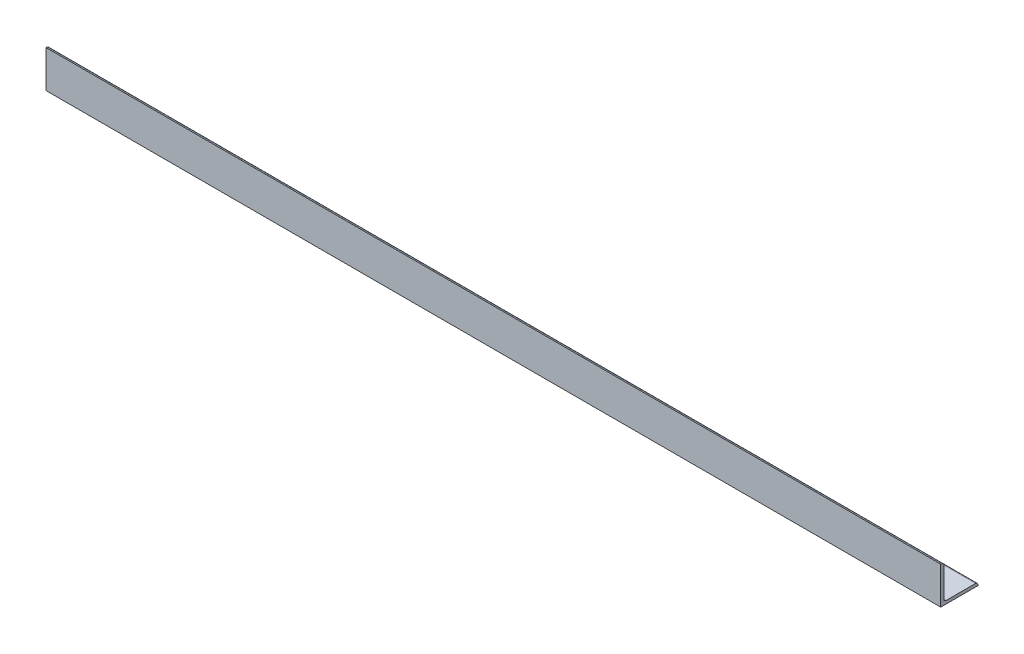
ISO-10303-21;
HEADER;
FILE_DESCRIPTION(('STEP AP214'),'2;1');
FILE_NAME('part.step','',(''),(''),'','','');
FILE_SCHEMA(('AUTOMOTIVE_DESIGN { 1 0 10303 214 1 1 1 1 }'));
ENDSEC;
DATA;
#1=APPLICATION_CONTEXT('core data for automotive mechanical design processes');
#2=APPLICATION_PROTOCOL_DEFINITION('international standard','automotive_design',2000,#1);
#3=PRODUCT_CONTEXT('',#1,'mechanical');
#4=PRODUCT('Part','Part','',(#3));
#5=PRODUCT_RELATED_PRODUCT_CATEGORY('part','',(#4));
#6=PRODUCT_DEFINITION_FORMATION('','',#4);
#7=PRODUCT_DEFINITION_CONTEXT('part definition',#1,'design');
#8=PRODUCT_DEFINITION('design','',#6,#7);
#9=PRODUCT_DEFINITION_SHAPE('','',#8);
#10=(LENGTH_UNIT() NAMED_UNIT(*) SI_UNIT(.MILLI.,.METRE.));
#11=(NAMED_UNIT(*) PLANE_ANGLE_UNIT() SI_UNIT($,.RADIAN.));
#12=(NAMED_UNIT(*) SI_UNIT($,.STERADIAN.) SOLID_ANGLE_UNIT());
#13=UNCERTAINTY_MEASURE_WITH_UNIT(LENGTH_MEASURE(1.E-05),#10,'distance_accuracy_value','');
#14=(GEOMETRIC_REPRESENTATION_CONTEXT(3) GLOBAL_UNCERTAINTY_ASSIGNED_CONTEXT((#13)) GLOBAL_UNIT_ASSIGNED_CONTEXT((#10,
#11,#12)) REPRESENTATION_CONTEXT('',''));
#15=CARTESIAN_POINT('',(0.,0.,0.));
#16=DIRECTION('',(0.,0.,1.));
#17=DIRECTION('',(1.,0.,0.));
#18=AXIS2_PLACEMENT_3D('',#15,#16,#17);
#19=CARTESIAN_POINT('',(-914.4,76.2,0.));
#20=DIRECTION('',(0.,1.,0.));
#21=DIRECTION('',(0.,0.,1.));
#22=AXIS2_PLACEMENT_3D('',#19,#20,#21);
#23=PLANE('',#22);
#24=DIRECTION('',(1.,0.,0.));
#25=VECTOR('',#24,1.);
#26=CARTESIAN_POINT('',(-914.4,76.2,0.));
#27=LINE('',#26,#25);
#28=CARTESIAN_POINT('',(-914.4,76.2,0.));
#29=VERTEX_POINT('',#28);
#30=CARTESIAN_POINT('',(914.4,76.2,0.));
#31=VERTEX_POINT('',#30);
#32=EDGE_CURVE('E40',#29,#31,#27,.T.);
#33=ORIENTED_EDGE('',*,*,#32,.T.);
#34=DIRECTION('',(0.,0.,1.));
#35=VECTOR('',#34,1.);
#36=CARTESIAN_POINT('',(914.4,76.2,0.));
#37=LINE('',#36,#35);
#38=CARTESIAN_POINT('',(914.4,76.2,-1.26999999999996));
#39=VERTEX_POINT('',#38);
#40=EDGE_CURVE('E107',#39,#31,#37,.T.);
#41=ORIENTED_EDGE('',*,*,#40,.F.);
#42=DIRECTION('',(1.,0.,0.));
#43=VECTOR('',#42,1.);
#44=CARTESIAN_POINT('',(-914.4,76.2,-1.26999999999996));
#45=LINE('',#44,#43);
#46=CARTESIAN_POINT('',(-914.4,76.2,-1.26999999999996));
#47=VERTEX_POINT('',#46);
#48=EDGE_CURVE('E11',#47,#39,#45,.T.);
#49=ORIENTED_EDGE('',*,*,#48,.F.);
#50=DIRECTION('',(0.,0.,1.));
#51=VECTOR('',#50,1.);
#52=CARTESIAN_POINT('',(-914.4,76.2,0.));
#53=LINE('',#52,#51);
#54=EDGE_CURVE('E108',#47,#29,#53,.T.);
#55=ORIENTED_EDGE('',*,*,#54,.T.);
#56=EDGE_LOOP('',(#33,#41,#49,#55));
#57=FACE_BOUND('',#56,.T.);
#58=ADVANCED_FACE('F37',(#57),#23,.T.);
#59=CARTESIAN_POINT('',(-914.4,71.12,-1.27));
#60=DIRECTION('',(1.,0.,0.));
#61=DIRECTION('',(0.,0.,-1.));
#62=AXIS2_PLACEMENT_3D('',#59,#60,#61);
#63=CYLINDRICAL_SURFACE('',#62,5.08);
#64=ORIENTED_EDGE('',*,*,#48,.T.);
#65=CARTESIAN_POINT('',(914.4,71.12,-1.27));
#66=DIRECTION('',(1.,0.,0.));
#67=DIRECTION('',(0.,0.,-1.));
#68=AXIS2_PLACEMENT_3D('',#65,#66,#67);
#69=CIRCLE('',#68,5.08);
#70=CARTESIAN_POINT('',(914.4,71.12,-6.35));
#71=VERTEX_POINT('',#70);
#72=EDGE_CURVE('E125',#71,#39,#69,.T.);
#73=ORIENTED_EDGE('',*,*,#72,.F.);
#74=DIRECTION('',(1.,0.,0.));
#75=VECTOR('',#74,1.);
#76=CARTESIAN_POINT('',(-914.4,71.12,-6.35));
#77=LINE('',#76,#75);
#78=CARTESIAN_POINT('',(-914.4,71.12,-6.35));
#79=VERTEX_POINT('',#78);
#80=EDGE_CURVE('E45',#79,#71,#77,.T.);
#81=ORIENTED_EDGE('',*,*,#80,.F.);
#82=CARTESIAN_POINT('',(-914.4,71.12,-1.27));
#83=DIRECTION('',(1.,0.,0.));
#84=DIRECTION('',(0.,0.,-1.));
#85=AXIS2_PLACEMENT_3D('',#82,#83,#84);
#86=CIRCLE('',#85,5.08);
#87=EDGE_CURVE('E113',#79,#47,#86,.T.);
#88=ORIENTED_EDGE('',*,*,#87,.T.);
#89=EDGE_LOOP('',(#64,#73,#81,#88));
#90=FACE_BOUND('',#89,.T.);
#91=ADVANCED_FACE('F201',(#90),#63,.T.);
#92=CARTESIAN_POINT('',(-914.4,71.12,-6.35));
#93=DIRECTION('',(0.,0.,-1.));
#94=DIRECTION('',(-1.,0.,0.));
#95=AXIS2_PLACEMENT_3D('',#92,#93,#94);
#96=PLANE('',#95);
#97=ORIENTED_EDGE('',*,*,#80,.T.);
#98=DIRECTION('',(0.,1.,0.));
#99=VECTOR('',#98,1.);
#100=CARTESIAN_POINT('',(914.4,71.12,-6.35));
#101=LINE('',#100,#99);
#102=CARTESIAN_POINT('',(914.4,11.43,-6.35));
#103=VERTEX_POINT('',#102);
#104=EDGE_CURVE('E141',#103,#71,#101,.T.);
#105=ORIENTED_EDGE('',*,*,#104,.F.);
#106=DIRECTION('',(1.,0.,0.));
#107=VECTOR('',#106,1.);
#108=CARTESIAN_POINT('',(-914.4,11.43,-6.35));
#109=LINE('',#108,#107);
#110=CARTESIAN_POINT('',(-914.4,11.43,-6.35));
#111=VERTEX_POINT('',#110);
#112=EDGE_CURVE('E166',#111,#103,#109,.T.);
#113=ORIENTED_EDGE('',*,*,#112,.F.);
#114=DIRECTION('',(0.,1.,0.));
#115=VECTOR('',#114,1.);
#116=CARTESIAN_POINT('',(-914.4,71.12,-6.35));
#117=LINE('',#116,#115);
#118=EDGE_CURVE('E162',#111,#79,#117,.T.);
#119=ORIENTED_EDGE('',*,*,#118,.T.);
#120=EDGE_LOOP('',(#97,#105,#113,#119));
#121=FACE_BOUND('',#120,.T.);
#122=ADVANCED_FACE('F199',(#121),#96,.T.);
#123=CARTESIAN_POINT('',(-914.4,11.43,-11.43));
#124=DIRECTION('',(1.,0.,0.));
#125=DIRECTION('',(0.,0.,-1.));
#126=AXIS2_PLACEMENT_3D('',#123,#124,#125);
#127=CYLINDRICAL_SURFACE('',#126,5.08);
#128=ORIENTED_EDGE('',*,*,#112,.T.);
#129=CARTESIAN_POINT('',(914.4,11.43,-11.43));
#130=DIRECTION('',(-1.,0.,0.));
#131=DIRECTION('',(0.,0.,-1.));
#132=AXIS2_PLACEMENT_3D('',#129,#130,#131);
#133=CIRCLE('',#132,5.08);
#134=CARTESIAN_POINT('',(914.4,6.35,-11.43));
#135=VERTEX_POINT('',#134);
#136=EDGE_CURVE('E138',#135,#103,#133,.T.);
#137=ORIENTED_EDGE('',*,*,#136,.F.);
#138=DIRECTION('',(1.,0.,0.));
#139=VECTOR('',#138,1.);
#140=CARTESIAN_POINT('',(-914.4,6.35,-11.43));
#141=LINE('',#140,#139);
#142=CARTESIAN_POINT('',(-914.4,6.35,-11.43));
#143=VERTEX_POINT('',#142);
#144=EDGE_CURVE('E168',#143,#135,#141,.T.);
#145=ORIENTED_EDGE('',*,*,#144,.F.);
#146=CARTESIAN_POINT('',(-914.4,11.43,-11.43));
#147=DIRECTION('',(-1.,0.,0.));
#148=DIRECTION('',(0.,0.,-1.));
#149=AXIS2_PLACEMENT_3D('',#146,#147,#148);
#150=CIRCLE('',#149,5.08);
#151=EDGE_CURVE('E159',#143,#111,#150,.T.);
#152=ORIENTED_EDGE('',*,*,#151,.T.);
#153=EDGE_LOOP('',(#128,#137,#145,#152));
#154=FACE_BOUND('',#153,.T.);
#155=ADVANCED_FACE('F197',(#154),#127,.F.);
#156=CARTESIAN_POINT('',(-914.4,6.35,-11.43));
#157=DIRECTION('',(0.,1.,0.));
#158=DIRECTION('',(0.,0.,1.));
#159=AXIS2_PLACEMENT_3D('',#156,#157,#158);
#160=PLANE('',#159);
#161=ORIENTED_EDGE('',*,*,#144,.T.);
#162=DIRECTION('',(0.,0.,1.));
#163=VECTOR('',#162,1.);
#164=CARTESIAN_POINT('',(914.4,6.35,-11.43));
#165=LINE('',#164,#163);
#166=CARTESIAN_POINT('',(914.4,6.35,-71.12));
#167=VERTEX_POINT('',#166);
#168=EDGE_CURVE('E135',#167,#135,#165,.T.);
#169=ORIENTED_EDGE('',*,*,#168,.F.);
#170=DIRECTION('',(1.,0.,0.));
#171=VECTOR('',#170,1.);
#172=CARTESIAN_POINT('',(-914.4,6.35,-71.12));
#173=LINE('',#172,#171);
#174=CARTESIAN_POINT('',(-914.4,6.35,-71.12));
#175=VERTEX_POINT('',#174);
#176=EDGE_CURVE('E170',#175,#167,#173,.T.);
#177=ORIENTED_EDGE('',*,*,#176,.F.);
#178=DIRECTION('',(0.,0.,1.));
#179=VECTOR('',#178,1.);
#180=CARTESIAN_POINT('',(-914.4,6.35,-11.43));
#181=LINE('',#180,#179);
#182=EDGE_CURVE('E156',#175,#143,#181,.T.);
#183=ORIENTED_EDGE('',*,*,#182,.T.);
#184=EDGE_LOOP('',(#161,#169,#177,#183));
#185=FACE_BOUND('',#184,.T.);
#186=ADVANCED_FACE('F192',(#185),#160,.T.);
#187=CARTESIAN_POINT('',(-914.4,1.27,-71.12));
#188=DIRECTION('',(1.,0.,0.));
#189=DIRECTION('',(0.,0.,-1.));
#190=AXIS2_PLACEMENT_3D('',#187,#188,#189);
#191=CYLINDRICAL_SURFACE('',#190,5.08);
#192=ORIENTED_EDGE('',*,*,#176,.T.);
#193=CARTESIAN_POINT('',(914.4,1.27,-71.12));
#194=DIRECTION('',(1.,0.,0.));
#195=DIRECTION('',(0.,0.,1.));
#196=AXIS2_PLACEMENT_3D('',#193,#194,#195);
#197=CIRCLE('',#196,5.08);
#198=CARTESIAN_POINT('',(914.4,1.26999999999996,-76.2));
#199=VERTEX_POINT('',#198);
#200=EDGE_CURVE('E132',#199,#167,#197,.T.);
#201=ORIENTED_EDGE('',*,*,#200,.F.);
#202=DIRECTION('',(1.,0.,0.));
#203=VECTOR('',#202,1.);
#204=CARTESIAN_POINT('',(-914.4,1.26999999999996,-76.2));
#205=LINE('',#204,#203);
#206=CARTESIAN_POINT('',(-914.4,1.26999999999996,-76.2));
#207=VERTEX_POINT('',#206);
#208=EDGE_CURVE('E172',#207,#199,#205,.T.);
#209=ORIENTED_EDGE('',*,*,#208,.F.);
#210=CARTESIAN_POINT('',(-914.4,1.27,-71.12));
#211=DIRECTION('',(1.,0.,0.));
#212=DIRECTION('',(0.,0.,1.));
#213=AXIS2_PLACEMENT_3D('',#210,#211,#212);
#214=CIRCLE('',#213,5.08);
#215=EDGE_CURVE('E153',#207,#175,#214,.T.);
#216=ORIENTED_EDGE('',*,*,#215,.T.);
#217=EDGE_LOOP('',(#192,#201,#209,#216));
#218=FACE_BOUND('',#217,.T.);
#219=ADVANCED_FACE('F185',(#218),#191,.T.);
#220=CARTESIAN_POINT('',(-914.4,1.26999999999996,-76.2));
#221=DIRECTION('',(0.,0.,-1.));
#222=DIRECTION('',(-1.,0.,0.));
#223=AXIS2_PLACEMENT_3D('',#220,#221,#222);
#224=PLANE('',#223);
#225=ORIENTED_EDGE('',*,*,#208,.T.);
#226=DIRECTION('',(0.,1.,0.));
#227=VECTOR('',#226,1.);
#228=CARTESIAN_POINT('',(914.4,1.26999999999996,-76.2));
#229=LINE('',#228,#227);
#230=CARTESIAN_POINT('',(914.4,0.,-76.2));
#231=VERTEX_POINT('',#230);
#232=EDGE_CURVE('E129',#231,#199,#229,.T.);
#233=ORIENTED_EDGE('',*,*,#232,.F.);
#234=DIRECTION('',(1.,0.,0.));
#235=VECTOR('',#234,1.);
#236=CARTESIAN_POINT('',(-914.4,0.,-76.2));
#237=LINE('',#236,#235);
#238=CARTESIAN_POINT('',(-914.4,0.,-76.2));
#239=VERTEX_POINT('',#238);
#240=EDGE_CURVE('E174',#239,#231,#237,.T.);
#241=ORIENTED_EDGE('',*,*,#240,.F.);
#242=DIRECTION('',(0.,1.,0.));
#243=VECTOR('',#242,1.);
#244=CARTESIAN_POINT('',(-914.4,1.26999999999996,-76.2));
#245=LINE('',#244,#243);
#246=EDGE_CURVE('E150',#239,#207,#245,.T.);
#247=ORIENTED_EDGE('',*,*,#246,.T.);
#248=EDGE_LOOP('',(#225,#233,#241,#247));
#249=FACE_BOUND('',#248,.T.);
#250=ADVANCED_FACE('F182',(#249),#224,.T.);
#251=CARTESIAN_POINT('',(-914.4,0.,0.));
#252=DIRECTION('',(0.,-1.,0.));
#253=DIRECTION('',(0.,0.,-1.));
#254=AXIS2_PLACEMENT_3D('',#251,#252,#253);
#255=PLANE('',#254);
#256=ORIENTED_EDGE('',*,*,#240,.T.);
#257=DIRECTION('',(0.,0.,-1.));
#258=VECTOR('',#257,1.);
#259=CARTESIAN_POINT('',(914.4,0.,0.));
#260=LINE('',#259,#258);
#261=CARTESIAN_POINT('',(914.4,0.,0.));
#262=VERTEX_POINT('',#261);
#263=EDGE_CURVE('E120',#262,#231,#260,.T.);
#264=ORIENTED_EDGE('',*,*,#263,.F.);
#265=DIRECTION('',(1.,0.,0.));
#266=VECTOR('',#265,1.);
#267=CARTESIAN_POINT('',(-914.4,0.,0.));
#268=LINE('',#267,#266);
#269=CARTESIAN_POINT('',(-914.4,0.,0.));
#270=VERTEX_POINT('',#269);
#271=EDGE_CURVE('E112',#270,#262,#268,.T.);
#272=ORIENTED_EDGE('',*,*,#271,.F.);
#273=DIRECTION('',(0.,0.,-1.));
#274=VECTOR('',#273,1.);
#275=CARTESIAN_POINT('',(-914.4,0.,0.));
#276=LINE('',#275,#274);
#277=EDGE_CURVE('E147',#270,#239,#276,.T.);
#278=ORIENTED_EDGE('',*,*,#277,.T.);
#279=EDGE_LOOP('',(#256,#264,#272,#278));
#280=FACE_BOUND('',#279,.T.);
#281=ADVANCED_FACE('F176',(#280),#255,.T.);
#282=CARTESIAN_POINT('',(-914.4,76.2,0.));
#283=DIRECTION('',(0.,0.,1.));
#284=DIRECTION('',(1.,0.,0.));
#285=AXIS2_PLACEMENT_3D('',#282,#283,#284);
#286=PLANE('',#285);
#287=ORIENTED_EDGE('',*,*,#271,.T.);
#288=DIRECTION('',(0.,-1.,0.));
#289=VECTOR('',#288,1.);
#290=CARTESIAN_POINT('',(914.4,76.2,0.));
#291=LINE('',#290,#289);
#292=EDGE_CURVE('E115',#31,#262,#291,.T.);
#293=ORIENTED_EDGE('',*,*,#292,.F.);
#294=ORIENTED_EDGE('',*,*,#32,.F.);
#295=DIRECTION('',(0.,-1.,0.));
#296=VECTOR('',#295,1.);
#297=CARTESIAN_POINT('',(-914.4,76.2,0.));
#298=LINE('',#297,#296);
#299=EDGE_CURVE('E145',#29,#270,#298,.T.);
#300=ORIENTED_EDGE('',*,*,#299,.T.);
#301=EDGE_LOOP('',(#287,#293,#294,#300));
#302=FACE_BOUND('',#301,.T.);
#303=ADVANCED_FACE('F116',(#302),#286,.T.);
#304=CARTESIAN_POINT('',(-914.4,71.12,-1.27));
#305=DIRECTION('',(1.,0.,0.));
#306=DIRECTION('',(0.,0.,-1.));
#307=AXIS2_PLACEMENT_3D('',#304,#305,#306);
#308=PLANE('',#307);
#309=ORIENTED_EDGE('',*,*,#54,.F.);
#310=ORIENTED_EDGE('',*,*,#87,.F.);
#311=ORIENTED_EDGE('',*,*,#118,.F.);
#312=ORIENTED_EDGE('',*,*,#151,.F.);
#313=ORIENTED_EDGE('',*,*,#182,.F.);
#314=ORIENTED_EDGE('',*,*,#215,.F.);
#315=ORIENTED_EDGE('',*,*,#246,.F.);
#316=ORIENTED_EDGE('',*,*,#277,.F.);
#317=ORIENTED_EDGE('',*,*,#299,.F.);
#318=EDGE_LOOP('',(#309,#310,#311,#312,#313,#314,#315,#316,#317));
#319=FACE_BOUND('',#318,.T.);
#320=ADVANCED_FACE('F188',(#319),#308,.F.);
#321=CARTESIAN_POINT('',(914.4,71.12,-1.27));
#322=DIRECTION('',(1.,0.,0.));
#323=DIRECTION('',(0.,0.,-1.));
#324=AXIS2_PLACEMENT_3D('',#321,#322,#323);
#325=PLANE('',#324);
#326=ORIENTED_EDGE('',*,*,#40,.T.);
#327=ORIENTED_EDGE('',*,*,#292,.T.);
#328=ORIENTED_EDGE('',*,*,#263,.T.);
#329=ORIENTED_EDGE('',*,*,#232,.T.);
#330=ORIENTED_EDGE('',*,*,#200,.T.);
#331=ORIENTED_EDGE('',*,*,#168,.T.);
#332=ORIENTED_EDGE('',*,*,#136,.T.);
#333=ORIENTED_EDGE('',*,*,#104,.T.);
#334=ORIENTED_EDGE('',*,*,#72,.T.);
#335=EDGE_LOOP('',(#326,#327,#328,#329,#330,#331,#332,#333,#334));
#336=FACE_BOUND('',#335,.T.);
#337=ADVANCED_FACE('F123',(#336),#325,.T.);
#338=CLOSED_SHELL('',(#58,#91,#122,#155,#186,#219,#250,#281,#303,#320,#337));
#339=MANIFOLD_SOLID_BREP('B2',#338);
#340=ADVANCED_BREP_SHAPE_REPRESENTATION('',(#18,#339),#14);
#341=SHAPE_DEFINITION_REPRESENTATION(#9,#340);
ENDSEC;
END-ISO-10303-21;
